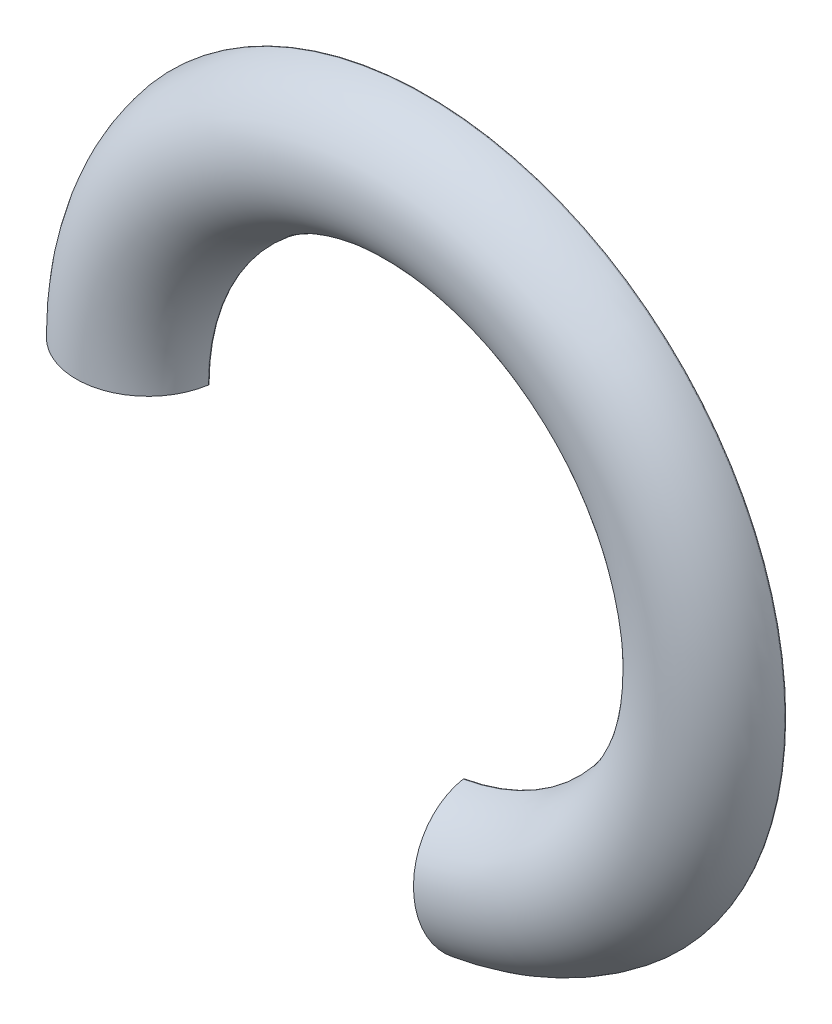
ISO-10303-21;
HEADER;
FILE_DESCRIPTION(('STEP AP214'),'2;1');
FILE_NAME('part.step','',(''),(''),'','','');
FILE_SCHEMA(('AUTOMOTIVE_DESIGN { 1 0 10303 214 1 1 1 1 }'));
ENDSEC;
DATA;
#1=APPLICATION_CONTEXT('core data for automotive mechanical design processes');
#2=APPLICATION_PROTOCOL_DEFINITION('international standard','automotive_design',2000,#1);
#3=PRODUCT_CONTEXT('',#1,'mechanical');
#4=PRODUCT('Part','Part','',(#3));
#5=PRODUCT_RELATED_PRODUCT_CATEGORY('part','',(#4));
#6=PRODUCT_DEFINITION_FORMATION('','',#4);
#7=PRODUCT_DEFINITION_CONTEXT('part definition',#1,'design');
#8=PRODUCT_DEFINITION('design','',#6,#7);
#9=PRODUCT_DEFINITION_SHAPE('','',#8);
#10=(LENGTH_UNIT() NAMED_UNIT(*) SI_UNIT(.MILLI.,.METRE.));
#11=(NAMED_UNIT(*) PLANE_ANGLE_UNIT() SI_UNIT($,.RADIAN.));
#12=(NAMED_UNIT(*) SI_UNIT($,.STERADIAN.) SOLID_ANGLE_UNIT());
#13=UNCERTAINTY_MEASURE_WITH_UNIT(LENGTH_MEASURE(1.E-05),#10,'distance_accuracy_value','');
#14=(GEOMETRIC_REPRESENTATION_CONTEXT(3) GLOBAL_UNCERTAINTY_ASSIGNED_CONTEXT((#13)) GLOBAL_UNIT_ASSIGNED_CONTEXT((#10,
#11,#12)) REPRESENTATION_CONTEXT('',''));
#15=CARTESIAN_POINT('',(0.,0.,0.));
#16=DIRECTION('',(0.,0.,1.));
#17=DIRECTION('',(1.,0.,0.));
#18=AXIS2_PLACEMENT_3D('',#15,#16,#17);
#19=CARTESIAN_POINT('',(-32.9401986776751,0.,1.4));
#20=DIRECTION('',(0.,0.,1.));
#21=DIRECTION('',(1.,0.,0.));
#22=AXIS2_PLACEMENT_3D('',#19,#20,#21);
#23=PLANE('',#22);
#24=DIRECTION('',(0.173648177666934,-0.984807753012208,0.));
#25=VECTOR('',#24,1.);
#26=CARTESIAN_POINT('',(-0.993268526521075,5.63310573645733,1.4));
#27=LINE('',#26,#25);
#28=CARTESIAN_POINT('',(5.52635858743321,-31.3415369855975,1.4));
#29=VERTEX_POINT('',#28);
#30=CARTESIAN_POINT('',(5.72000547236503,-32.4397630435369,1.4));
#31=VERTEX_POINT('',#30);
#32=EDGE_CURVE('E98',#29,#31,#27,.T.);
#33=ORIENTED_EDGE('',*,*,#32,.F.);
#34=CARTESIAN_POINT('',(0.,0.,1.4));
#35=DIRECTION('',(0.,0.,1.));
#36=DIRECTION('',(-1.,0.,0.));
#37=AXIS2_PLACEMENT_3D('',#34,#35,#36);
#38=CIRCLE('',#37,31.8250307125771);
#39=CARTESIAN_POINT('',(-31.8250307125771,0.,1.4));
#40=VERTEX_POINT('',#39);
#41=EDGE_CURVE('E106',#29,#40,#38,.T.);
#42=ORIENTED_EDGE('',*,*,#41,.T.);
#43=DIRECTION('',(-1.,0.,0.));
#44=VECTOR('',#43,1.);
#45=CARTESIAN_POINT('',(-32.9401986776751,0.,1.4));
#46=LINE('',#45,#44);
#47=CARTESIAN_POINT('',(-32.9401986776751,0.,1.4));
#48=VERTEX_POINT('',#47);
#49=EDGE_CURVE('E56',#40,#48,#46,.T.);
#50=ORIENTED_EDGE('',*,*,#49,.T.);
#51=CARTESIAN_POINT('',(0.,0.,1.4));
#52=DIRECTION('',(0.,0.,1.));
#53=DIRECTION('',(-1.,0.,0.));
#54=AXIS2_PLACEMENT_3D('',#51,#52,#53);
#55=CIRCLE('',#54,32.9401986776751);
#56=EDGE_CURVE('E109',#31,#48,#55,.T.);
#57=ORIENTED_EDGE('',*,*,#56,.F.);
#58=EDGE_LOOP('',(#33,#42,#50,#57));
#59=FACE_BOUND('',#58,.T.);
#60=ADVANCED_FACE('F34',(#59),#23,.F.);
#61=CARTESIAN_POINT('',(0.,0.,1.6));
#62=DIRECTION('',(0.,0.,1.));
#63=DIRECTION('',(1.,0.,0.));
#64=AXIS2_PLACEMENT_3D('',#61,#62,#63);
#65=TOROIDAL_SURFACE('',#64,32.9401986776751,0.2);
#66=CARTESIAN_POINT('',(5.72000547236503,-32.4397630435369,1.6));
#67=DIRECTION('',(-0.984807753012207,-0.173648177666934,0.));
#68=DIRECTION('',(0.173648177666934,-0.984807753012208,0.));
#69=AXIS2_PLACEMENT_3D('',#66,#67,#68);
#70=CIRCLE('',#69,0.2);
#71=CARTESIAN_POINT('',(5.7542058634443,-32.6337230996886,1.56521739130435));
#72=VERTEX_POINT('',#71);
#73=EDGE_CURVE('E110',#31,#72,#70,.T.);
#74=ORIENTED_EDGE('',*,*,#73,.F.);
#75=ORIENTED_EDGE('',*,*,#56,.T.);
#76=CARTESIAN_POINT('',(-32.9401986776751,0.,1.6));
#77=DIRECTION('',(0.,1.,0.));
#78=DIRECTION('',(0.,0.,1.));
#79=AXIS2_PLACEMENT_3D('',#76,#77,#78);
#80=CIRCLE('',#79,0.2);
#81=CARTESIAN_POINT('',(-33.1371508803343,0.,1.56521739130435));
#82=VERTEX_POINT('',#81);
#83=EDGE_CURVE('E119',#48,#82,#80,.T.);
#84=ORIENTED_EDGE('',*,*,#83,.T.);
#85=CARTESIAN_POINT('',(0.,0.,1.56521739130435));
#86=DIRECTION('',(0.,0.,1.));
#87=DIRECTION('',(-1.,0.,0.));
#88=AXIS2_PLACEMENT_3D('',#85,#86,#87);
#89=CIRCLE('',#88,33.1371508803343);
#90=EDGE_CURVE('E114',#72,#82,#89,.T.);
#91=ORIENTED_EDGE('',*,*,#90,.F.);
#92=EDGE_LOOP('',(#74,#75,#84,#91));
#93=FACE_BOUND('',#92,.T.);
#94=ADVANCED_FACE('F161',(#93),#65,.T.);
#95=CARTESIAN_POINT('',(0.,0.,0.));
#96=DIRECTION('',(0.,0.,1.));
#97=DIRECTION('',(1.,0.,0.));
#98=AXIS2_PLACEMENT_3D('',#95,#96,#97);
#99=TOROIDAL_SURFACE('',#98,42.,9.);
#100=CARTESIAN_POINT('',(7.29322346201123,-41.3619256265127,0.));
#101=DIRECTION('',(-0.984807753012207,-0.173648177666934,0.));
#102=DIRECTION('',(0.173648177666934,-0.984807753012208,0.));
#103=AXIS2_PLACEMENT_3D('',#100,#101,#102);
#104=CIRCLE('',#103,9.);
#105=CARTESIAN_POINT('',(8.83224106057816,-50.0901281533369,1.56521739130435));
#106=VERTEX_POINT('',#105);
#107=EDGE_CURVE('E253',#72,#106,#104,.F.);
#108=ORIENTED_EDGE('',*,*,#107,.F.);
#109=ORIENTED_EDGE('',*,*,#90,.T.);
#110=CARTESIAN_POINT('',(-42.,0.,0.));
#111=DIRECTION('',(0.,-1.,0.));
#112=DIRECTION('',(0.,0.,1.));
#113=AXIS2_PLACEMENT_3D('',#110,#111,#112);
#114=CIRCLE('',#113,9.);
#115=CARTESIAN_POINT('',(-50.8628491196657,0.,1.56521739130435));
#116=VERTEX_POINT('',#115);
#117=EDGE_CURVE('E122',#82,#116,#114,.T.);
#118=ORIENTED_EDGE('',*,*,#117,.T.);
#119=CARTESIAN_POINT('',(0.,0.,1.56521739130435));
#120=DIRECTION('',(0.,0.,1.));
#121=DIRECTION('',(-1.,0.,0.));
#122=AXIS2_PLACEMENT_3D('',#119,#120,#121);
#123=CIRCLE('',#122,50.8628491196657);
#124=EDGE_CURVE('E125',#106,#116,#123,.T.);
#125=ORIENTED_EDGE('',*,*,#124,.F.);
#126=EDGE_LOOP('',(#108,#109,#118,#125));
#127=FACE_BOUND('',#126,.T.);
#128=ADVANCED_FACE('F165',(#127),#99,.F.);
#129=CARTESIAN_POINT('',(0.,0.,1.6));
#130=DIRECTION('',(0.,0.,1.));
#131=DIRECTION('',(1.,0.,0.));
#132=AXIS2_PLACEMENT_3D('',#129,#130,#131);
#133=TOROIDAL_SURFACE('',#132,51.0598013223249,0.2);
#134=CARTESIAN_POINT('',(8.86644145165742,-50.2840882094885,1.6));
#135=DIRECTION('',(-0.984807753012207,-0.173648177666934,0.));
#136=DIRECTION('',(0.173648177666934,-0.984807753012208,0.));
#137=AXIS2_PLACEMENT_3D('',#134,#135,#136);
#138=CIRCLE('',#137,0.2);
#139=CARTESIAN_POINT('',(8.86644145165743,-50.2840882094885,1.4));
#140=VERTEX_POINT('',#139);
#141=EDGE_CURVE('E250',#106,#140,#138,.T.);
#142=ORIENTED_EDGE('',*,*,#141,.F.);
#143=ORIENTED_EDGE('',*,*,#124,.T.);
#144=CARTESIAN_POINT('',(-51.0598013223249,0.,1.6));
#145=DIRECTION('',(0.,1.,0.));
#146=DIRECTION('',(0.,0.,-1.));
#147=AXIS2_PLACEMENT_3D('',#144,#145,#146);
#148=CIRCLE('',#147,0.2);
#149=CARTESIAN_POINT('',(-51.0598013223249,0.,1.4));
#150=VERTEX_POINT('',#149);
#151=EDGE_CURVE('E128',#116,#150,#148,.T.);
#152=ORIENTED_EDGE('',*,*,#151,.T.);
#153=CARTESIAN_POINT('',(0.,0.,1.4));
#154=DIRECTION('',(0.,0.,1.));
#155=DIRECTION('',(-1.,0.,0.));
#156=AXIS2_PLACEMENT_3D('',#153,#154,#155);
#157=CIRCLE('',#156,51.0598013223249);
#158=EDGE_CURVE('E131',#140,#150,#157,.T.);
#159=ORIENTED_EDGE('',*,*,#158,.F.);
#160=EDGE_LOOP('',(#142,#143,#152,#159));
#161=FACE_BOUND('',#160,.T.);
#162=ADVANCED_FACE('F171',(#161),#133,.T.);
#163=CARTESIAN_POINT('',(-52.1749692874229,0.,1.4));
#164=DIRECTION('',(0.,0.,1.));
#165=DIRECTION('',(1.,0.,0.));
#166=AXIS2_PLACEMENT_3D('',#163,#164,#165);
#167=PLANE('',#166);
#168=DIRECTION('',(0.173648177666934,-0.984807753012208,0.));
#169=VECTOR('',#168,1.);
#170=CARTESIAN_POINT('',(-1.57326782915016,8.92244523684856,1.4));
#171=LINE('',#170,#169);
#172=CARTESIAN_POINT('',(9.06008833658924,-51.3823142674279,1.4));
#173=VERTEX_POINT('',#172);
#174=EDGE_CURVE('E244',#140,#173,#171,.T.);
#175=ORIENTED_EDGE('',*,*,#174,.F.);
#176=ORIENTED_EDGE('',*,*,#158,.T.);
#177=DIRECTION('',(-1.,0.,0.));
#178=VECTOR('',#177,1.);
#179=CARTESIAN_POINT('',(-52.1749692874229,0.,1.4));
#180=LINE('',#179,#178);
#181=CARTESIAN_POINT('',(-52.1749692874229,0.,1.4));
#182=VERTEX_POINT('',#181);
#183=EDGE_CURVE('E134',#150,#182,#180,.T.);
#184=ORIENTED_EDGE('',*,*,#183,.T.);
#185=CARTESIAN_POINT('',(0.,0.,1.4));
#186=DIRECTION('',(0.,0.,1.));
#187=DIRECTION('',(-1.,0.,0.));
#188=AXIS2_PLACEMENT_3D('',#185,#186,#187);
#189=CIRCLE('',#188,52.1749692874229);
#190=EDGE_CURVE('E137',#173,#182,#189,.T.);
#191=ORIENTED_EDGE('',*,*,#190,.F.);
#192=EDGE_LOOP('',(#175,#176,#184,#191));
#193=FACE_BOUND('',#192,.T.);
#194=ADVANCED_FACE('F175',(#193),#167,.F.);
#195=CARTESIAN_POINT('',(0.,0.,1.6));
#196=DIRECTION('',(0.,0.,1.));
#197=DIRECTION('',(1.,0.,0.));
#198=AXIS2_PLACEMENT_3D('',#195,#196,#197);
#199=TOROIDAL_SURFACE('',#198,52.1749692874229,0.200000000000001);
#200=CARTESIAN_POINT('',(9.06008833658924,-51.3823142674279,1.6));
#201=DIRECTION('',(-0.984807753012207,-0.173648177666934,0.));
#202=DIRECTION('',(0.173648177666934,-0.984807753012208,0.));
#203=AXIS2_PLACEMENT_3D('',#200,#201,#202);
#204=CIRCLE('',#203,0.200000000000001);
#205=CARTESIAN_POINT('',(9.09439639240629,-51.5768849206496,1.63106796116505));
#206=VERTEX_POINT('',#205);
#207=EDGE_CURVE('E242',#173,#206,#204,.T.);
#208=ORIENTED_EDGE('',*,*,#207,.F.);
#209=ORIENTED_EDGE('',*,*,#190,.T.);
#210=CARTESIAN_POINT('',(-52.1749692874229,0.,1.6));
#211=DIRECTION('',(0.,1.,0.));
#212=DIRECTION('',(0.,0.,-1.));
#213=AXIS2_PLACEMENT_3D('',#210,#211,#212);
#214=CIRCLE('',#213,0.200000000000001);
#215=CARTESIAN_POINT('',(-52.3725415065962,0.,1.63106796116505));
#216=VERTEX_POINT('',#215);
#217=EDGE_CURVE('E140',#182,#216,#214,.T.);
#218=ORIENTED_EDGE('',*,*,#217,.T.);
#219=CARTESIAN_POINT('',(0.,0.,1.63106796116505));
#220=DIRECTION('',(0.,0.,1.));
#221=DIRECTION('',(-1.,0.,0.));
#222=AXIS2_PLACEMENT_3D('',#219,#220,#221);
#223=CIRCLE('',#222,52.3725415065962);
#224=EDGE_CURVE('E143',#206,#216,#223,.T.);
#225=ORIENTED_EDGE('',*,*,#224,.F.);
#226=EDGE_LOOP('',(#208,#209,#218,#225));
#227=FACE_BOUND('',#226,.T.);
#228=ADVANCED_FACE('F179',(#227),#199,.T.);
#229=CARTESIAN_POINT('',(0.,0.,1.6));
#230=DIRECTION('',(0.,0.,1.));
#231=DIRECTION('',(1.,0.,0.));
#232=AXIS2_PLACEMENT_3D('',#229,#230,#231);
#233=TOROIDAL_SURFACE('',#232,31.8250307125771,0.200000000000001);
#234=CARTESIAN_POINT('',(5.52635858743321,-31.3415369855975,1.6));
#235=DIRECTION('',(-0.984807753012207,-0.173648177666934,0.));
#236=DIRECTION('',(0.173648177666934,-0.984807753012208,0.));
#237=AXIS2_PLACEMENT_3D('',#234,#235,#236);
#238=CIRCLE('',#237,0.200000000000001);
#239=CARTESIAN_POINT('',(5.49205053161616,-31.1469663323759,1.63106796116505));
#240=VERTEX_POINT('',#239);
#241=EDGE_CURVE('E11',#240,#29,#238,.T.);
#242=ORIENTED_EDGE('',*,*,#241,.F.);
#243=CARTESIAN_POINT('',(0.,0.,1.63106796116505));
#244=DIRECTION('',(0.,0.,1.));
#245=DIRECTION('',(-1.,0.,0.));
#246=AXIS2_PLACEMENT_3D('',#243,#244,#245);
#247=CIRCLE('',#246,31.6274584934038);
#248=CARTESIAN_POINT('',(-31.6274584934038,0.,1.63106796116505));
#249=VERTEX_POINT('',#248);
#250=EDGE_CURVE('E42',#240,#249,#247,.T.);
#251=ORIENTED_EDGE('',*,*,#250,.T.);
#252=CARTESIAN_POINT('',(-31.8250307125771,0.,1.6));
#253=DIRECTION('',(0.,1.,0.));
#254=DIRECTION('',(0.,0.,-1.));
#255=AXIS2_PLACEMENT_3D('',#252,#253,#254);
#256=CIRCLE('',#255,0.200000000000001);
#257=EDGE_CURVE('E112',#249,#40,#256,.T.);
#258=ORIENTED_EDGE('',*,*,#257,.T.);
#259=ORIENTED_EDGE('',*,*,#41,.F.);
#260=EDGE_LOOP('',(#242,#251,#258,#259));
#261=FACE_BOUND('',#260,.T.);
#262=ADVANCED_FACE('F36',(#261),#233,.T.);
#263=CARTESIAN_POINT('',(0.,0.,0.));
#264=DIRECTION('',(0.,0.,1.));
#265=DIRECTION('',(1.,0.,0.));
#266=AXIS2_PLACEMENT_3D('',#263,#264,#265);
#267=TOROIDAL_SURFACE('',#266,42.,10.5);
#268=CARTESIAN_POINT('',(7.29322346201123,-41.3619256265127,0.));
#269=DIRECTION('',(-0.984807753012207,-0.173648177666934,0.));
#270=DIRECTION('',(0.173648177666934,-0.984807753012208,0.));
#271=AXIS2_PLACEMENT_3D('',#268,#269,#270);
#272=CIRCLE('',#271,10.5);
#273=EDGE_CURVE('E48',#206,#240,#272,.T.);
#274=ORIENTED_EDGE('',*,*,#273,.F.);
#275=ORIENTED_EDGE('',*,*,#224,.T.);
#276=CARTESIAN_POINT('',(-42.,0.,0.));
#277=DIRECTION('',(0.,1.,0.));
#278=DIRECTION('',(0.,0.,1.));
#279=AXIS2_PLACEMENT_3D('',#276,#277,#278);
#280=CIRCLE('',#279,10.5);
#281=EDGE_CURVE('E116',#216,#249,#280,.T.);
#282=ORIENTED_EDGE('',*,*,#281,.T.);
#283=ORIENTED_EDGE('',*,*,#250,.F.);
#284=EDGE_LOOP('',(#274,#275,#282,#283));
#285=FACE_BOUND('',#284,.T.);
#286=ADVANCED_FACE('F150',(#285),#267,.T.);
#287=CARTESIAN_POINT('',(0.,0.,1.4));
#288=DIRECTION('',(-0.984807753012207,-0.173648177666934,0.));
#289=DIRECTION('',(0.173648177666934,-0.984807753012208,0.));
#290=AXIS2_PLACEMENT_3D('',#287,#288,#289);
#291=PLANE('',#290);
#292=ORIENTED_EDGE('',*,*,#32,.T.);
#293=ORIENTED_EDGE('',*,*,#73,.T.);
#294=ORIENTED_EDGE('',*,*,#107,.T.);
#295=ORIENTED_EDGE('',*,*,#141,.T.);
#296=ORIENTED_EDGE('',*,*,#174,.T.);
#297=ORIENTED_EDGE('',*,*,#207,.T.);
#298=ORIENTED_EDGE('',*,*,#273,.T.);
#299=ORIENTED_EDGE('',*,*,#241,.T.);
#300=EDGE_LOOP('',(#292,#293,#294,#295,#296,#297,#298,#299));
#301=FACE_BOUND('',#300,.T.);
#302=ADVANCED_FACE('F97',(#301),#291,.T.);
#303=CARTESIAN_POINT('',(0.,0.,1.4));
#304=DIRECTION('',(0.,-1.,0.));
#305=DIRECTION('',(1.,0.,0.));
#306=AXIS2_PLACEMENT_3D('',#303,#304,#305);
#307=PLANE('',#306);
#308=ORIENTED_EDGE('',*,*,#83,.F.);
#309=ORIENTED_EDGE('',*,*,#49,.F.);
#310=ORIENTED_EDGE('',*,*,#257,.F.);
#311=ORIENTED_EDGE('',*,*,#281,.F.);
#312=ORIENTED_EDGE('',*,*,#217,.F.);
#313=ORIENTED_EDGE('',*,*,#183,.F.);
#314=ORIENTED_EDGE('',*,*,#151,.F.);
#315=ORIENTED_EDGE('',*,*,#117,.F.);
#316=EDGE_LOOP('',(#308,#309,#310,#311,#312,#313,#314,#315));
#317=FACE_BOUND('',#316,.T.);
#318=ADVANCED_FACE('F152',(#317),#307,.T.);
#319=CLOSED_SHELL('',(#60,#94,#128,#162,#194,#228,#262,#286,#302,#318));
#320=MANIFOLD_SOLID_BREP('B2',#319);
#321=ADVANCED_BREP_SHAPE_REPRESENTATION('',(#18,#320),#14);
#322=SHAPE_DEFINITION_REPRESENTATION(#9,#321);
ENDSEC;
END-ISO-10303-21;
